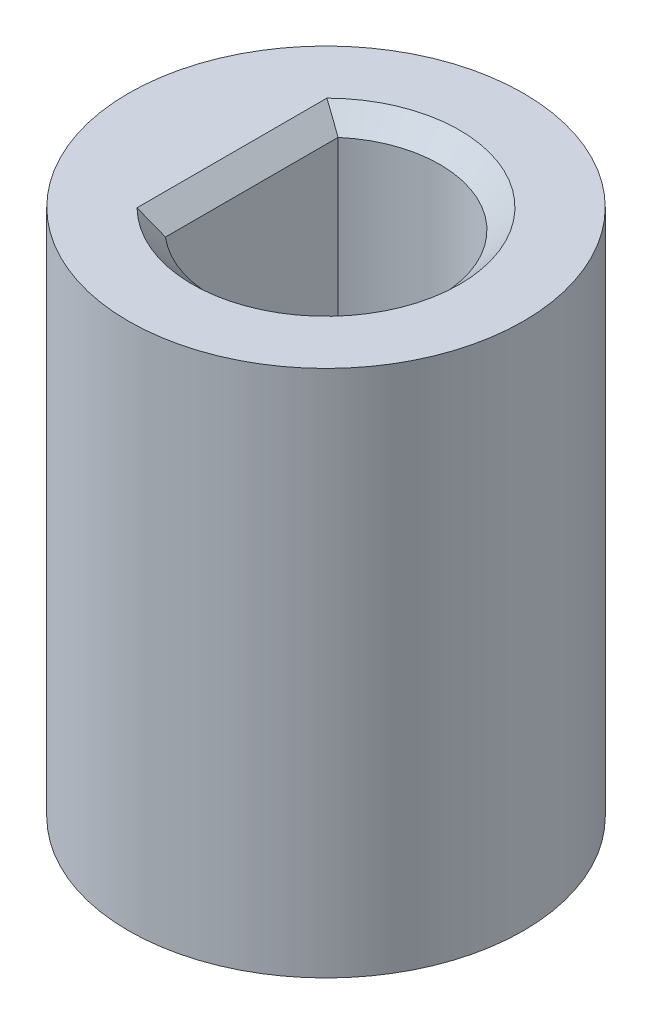
ISO-10303-21;
HEADER;
FILE_DESCRIPTION(('STEP AP214'),'2;1');
FILE_NAME('part.step','',(''),(''),'','','');
FILE_SCHEMA(('AUTOMOTIVE_DESIGN { 1 0 10303 214 1 1 1 1 }'));
ENDSEC;
DATA;
#1=APPLICATION_CONTEXT('core data for automotive mechanical design processes');
#2=APPLICATION_PROTOCOL_DEFINITION('international standard','automotive_design',2000,#1);
#3=PRODUCT_CONTEXT('',#1,'mechanical');
#4=PRODUCT('Part','Part','',(#3));
#5=PRODUCT_RELATED_PRODUCT_CATEGORY('part','',(#4));
#6=PRODUCT_DEFINITION_FORMATION('','',#4);
#7=PRODUCT_DEFINITION_CONTEXT('part definition',#1,'design');
#8=PRODUCT_DEFINITION('design','',#6,#7);
#9=PRODUCT_DEFINITION_SHAPE('','',#8);
#10=(LENGTH_UNIT() NAMED_UNIT(*) SI_UNIT(.MILLI.,.METRE.));
#11=(NAMED_UNIT(*) PLANE_ANGLE_UNIT() SI_UNIT($,.RADIAN.));
#12=(NAMED_UNIT(*) SI_UNIT($,.STERADIAN.) SOLID_ANGLE_UNIT());
#13=UNCERTAINTY_MEASURE_WITH_UNIT(LENGTH_MEASURE(1.E-05),#10,'distance_accuracy_value','');
#14=(GEOMETRIC_REPRESENTATION_CONTEXT(3) GLOBAL_UNCERTAINTY_ASSIGNED_CONTEXT((#13)) GLOBAL_UNIT_ASSIGNED_CONTEXT((#10,
#11,#12)) REPRESENTATION_CONTEXT('',''));
#15=CARTESIAN_POINT('',(0.,0.,0.));
#16=DIRECTION('',(0.,0.,1.));
#17=DIRECTION('',(1.,0.,0.));
#18=AXIS2_PLACEMENT_3D('',#15,#16,#17);
#19=CARTESIAN_POINT('',(-1.125,8.,0.));
#20=DIRECTION('',(1.,0.,0.));
#21=DIRECTION('',(0.,0.,-1.));
#22=AXIS2_PLACEMENT_3D('',#19,#20,#21);
#23=PLANE('',#22);
#24=DIRECTION('',(0.,-1.,0.));
#25=VECTOR('',#24,1.);
#26=CARTESIAN_POINT('',(-1.125,8.,-1.3076696830622));
#27=LINE('',#26,#25);
#28=CARTESIAN_POINT('',(-1.125,7.7,-1.3076696830622));
#29=VERTEX_POINT('',#28);
#30=CARTESIAN_POINT('',(-1.125,0.,-1.3076696830622));
#31=VERTEX_POINT('',#30);
#32=EDGE_CURVE('E83',#29,#31,#27,.T.);
#33=ORIENTED_EDGE('',*,*,#32,.F.);
#34=DIRECTION('',(0.,0.,1.));
#35=VECTOR('',#34,1.);
#36=CARTESIAN_POINT('',(-1.125,7.7,0.));
#37=LINE('',#36,#35);
#38=CARTESIAN_POINT('',(-1.125,7.7,1.3076696830622));
#39=VERTEX_POINT('',#38);
#40=EDGE_CURVE('E11',#29,#39,#37,.T.);
#41=ORIENTED_EDGE('',*,*,#40,.T.);
#42=DIRECTION('',(0.,-1.,0.));
#43=VECTOR('',#42,1.);
#44=CARTESIAN_POINT('',(-1.125,8.,1.3076696830622));
#45=LINE('',#44,#43);
#46=CARTESIAN_POINT('',(-1.125,0.,1.3076696830622));
#47=VERTEX_POINT('',#46);
#48=EDGE_CURVE('E91',#39,#47,#45,.T.);
#49=ORIENTED_EDGE('',*,*,#48,.T.);
#50=DIRECTION('',(0.,0.,1.));
#51=VECTOR('',#50,1.);
#52=CARTESIAN_POINT('',(-1.125,0.,0.));
#53=LINE('',#52,#51);
#54=EDGE_CURVE('E94',#31,#47,#53,.T.);
#55=ORIENTED_EDGE('',*,*,#54,.F.);
#56=EDGE_LOOP('',(#33,#41,#49,#55));
#57=FACE_BOUND('',#56,.T.);
#58=ADVANCED_FACE('F40',(#57),#23,.T.);
#59=CARTESIAN_POINT('',(0.,8.,0.));
#60=DIRECTION('',(0.,-1.,0.));
#61=DIRECTION('',(0.,0.,-1.));
#62=AXIS2_PLACEMENT_3D('',#59,#60,#61);
#63=CYLINDRICAL_SURFACE('',#62,1.725);
#64=ORIENTED_EDGE('',*,*,#48,.F.);
#65=CARTESIAN_POINT('',(0.,7.7,0.));
#66=DIRECTION('',(0.,1.,0.));
#67=DIRECTION('',(0.,0.,1.));
#68=AXIS2_PLACEMENT_3D('',#65,#66,#67);
#69=CIRCLE('',#68,1.725);
#70=EDGE_CURVE('E89',#39,#29,#69,.T.);
#71=ORIENTED_EDGE('',*,*,#70,.T.);
#72=ORIENTED_EDGE('',*,*,#32,.T.);
#73=CARTESIAN_POINT('',(0.,0.,0.));
#74=DIRECTION('',(0.,1.,0.));
#75=DIRECTION('',(0.,0.,1.));
#76=AXIS2_PLACEMENT_3D('',#73,#74,#75);
#77=CIRCLE('',#76,1.725);
#78=EDGE_CURVE('E88',#47,#31,#77,.T.);
#79=ORIENTED_EDGE('',*,*,#78,.F.);
#80=EDGE_LOOP('',(#64,#71,#72,#79));
#81=FACE_BOUND('',#80,.T.);
#82=ADVANCED_FACE('F86',(#81),#63,.F.);
#83=CARTESIAN_POINT('',(0.,8.,0.));
#84=DIRECTION('',(0.,-1.,0.));
#85=DIRECTION('',(0.,0.,-1.));
#86=AXIS2_PLACEMENT_3D('',#83,#84,#85);
#87=CYLINDRICAL_SURFACE('',#86,2.99246166358923);
#88=CARTESIAN_POINT('',(0.,8.,0.));
#89=DIRECTION('',(0.,1.,0.));
#90=DIRECTION('',(0.,0.,1.));
#91=AXIS2_PLACEMENT_3D('',#88,#89,#90);
#92=CIRCLE('',#91,2.99246166358923);
#93=CARTESIAN_POINT('',(0.,8.,2.99246166358923));
#94=VERTEX_POINT('',#93);
#95=EDGE_CURVE('E102',#94,#94,#92,.T.);
#96=ORIENTED_EDGE('',*,*,#95,.F.);
#97=EDGE_LOOP('',(#96));
#98=FACE_BOUND('',#97,.T.);
#99=CARTESIAN_POINT('',(0.,0.,0.));
#100=DIRECTION('',(0.,1.,0.));
#101=DIRECTION('',(0.,0.,1.));
#102=AXIS2_PLACEMENT_3D('',#99,#100,#101);
#103=CIRCLE('',#102,2.99246166358923);
#104=CARTESIAN_POINT('',(0.,0.,2.99246166358923));
#105=VERTEX_POINT('',#104);
#106=EDGE_CURVE('E99',#105,#105,#103,.T.);
#107=ORIENTED_EDGE('',*,*,#106,.T.);
#108=EDGE_LOOP('',(#107));
#109=FACE_BOUND('',#108,.T.);
#110=ADVANCED_FACE('F126',(#98,#109),#87,.T.);
#111=CARTESIAN_POINT('',(0.,8.,0.));
#112=DIRECTION('',(0.,1.,0.));
#113=DIRECTION('',(0.,0.,1.));
#114=AXIS2_PLACEMENT_3D('',#111,#112,#113);
#115=PLANE('',#114);
#116=DIRECTION('',(0.,0.,-1.));
#117=VECTOR('',#116,1.);
#118=CARTESIAN_POINT('',(-1.425,8.,0.));
#119=LINE('',#118,#117);
#120=CARTESIAN_POINT('',(-1.425,8.,1.43874945699382));
#121=VERTEX_POINT('',#120);
#122=CARTESIAN_POINT('',(-1.425,8.,-1.43874945699382));
#123=VERTEX_POINT('',#122);
#124=EDGE_CURVE('E62',#121,#123,#119,.T.);
#125=ORIENTED_EDGE('',*,*,#124,.T.);
#126=CARTESIAN_POINT('',(0.,8.,0.));
#127=DIRECTION('',(0.,1.,0.));
#128=DIRECTION('',(0.,0.,1.));
#129=AXIS2_PLACEMENT_3D('',#126,#127,#128);
#130=CIRCLE('',#129,2.025);
#131=EDGE_CURVE('E55',#123,#121,#130,.F.);
#132=ORIENTED_EDGE('',*,*,#131,.T.);
#133=EDGE_LOOP('',(#125,#132));
#134=FACE_BOUND('',#133,.T.);
#135=ORIENTED_EDGE('',*,*,#95,.T.);
#136=EDGE_LOOP('',(#135));
#137=FACE_BOUND('',#136,.T.);
#138=ADVANCED_FACE('F129',(#134,#137),#115,.T.);
#139=CARTESIAN_POINT('',(0.,0.,0.));
#140=DIRECTION('',(0.,1.,0.));
#141=DIRECTION('',(0.,0.,1.));
#142=AXIS2_PLACEMENT_3D('',#139,#140,#141);
#143=PLANE('',#142);
#144=ORIENTED_EDGE('',*,*,#54,.T.);
#145=ORIENTED_EDGE('',*,*,#78,.T.);
#146=EDGE_LOOP('',(#144,#145));
#147=FACE_BOUND('',#146,.T.);
#148=ORIENTED_EDGE('',*,*,#106,.F.);
#149=EDGE_LOOP('',(#148));
#150=FACE_BOUND('',#149,.T.);
#151=ADVANCED_FACE('F97',(#147,#150),#143,.F.);
#152=CARTESIAN_POINT('',(-1.125,7.7,0.));
#153=DIRECTION('',(-0.707106781186545,-0.70710678118655,0.));
#154=DIRECTION('',(0.,0.,1.));
#155=AXIS2_PLACEMENT_3D('',#152,#153,#154);
#156=PLANE('',#155);
#157=CARTESIAN_POINT('',(-1.125,7.7,-1.3076696830622));
#158=CARTESIAN_POINT('',(-1.17479233663844,7.74979233663845,-1.33046777184846));
#159=CARTESIAN_POINT('',(-1.22468859594161,7.79968859594161,-1.35279016860113));
#160=CARTESIAN_POINT('',(-1.32468859744819,7.89968859744818,-1.39648341968219));
#161=CARTESIAN_POINT('',(-1.37479233814502,7.94979233814502,-1.41785428090673));
#162=CARTESIAN_POINT('',(-1.425,8.,-1.43874945699382));
#163=B_SPLINE_CURVE_WITH_KNOTS('',3,(#157,#158,#159,#160,#161,#162),.UNSPECIFIED.,.F.,.F.,(4,2,
4),(0.,0.222031675747249,0.444061742085084),.UNSPECIFIED.);
#164=EDGE_CURVE('E109',#123,#29,#163,.F.);
#165=ORIENTED_EDGE('',*,*,#164,.F.);
#166=ORIENTED_EDGE('',*,*,#124,.F.);
#167=CARTESIAN_POINT('',(-1.425,8.,1.43874945699382));
#168=CARTESIAN_POINT('',(-1.37479233814502,7.94979233814502,1.41785428090673));
#169=CARTESIAN_POINT('',(-1.32468859744819,7.89968859744818,1.39648341968219));
#170=CARTESIAN_POINT('',(-1.22468859594161,7.79968859594161,1.35279016860113));
#171=CARTESIAN_POINT('',(-1.17479233663845,7.74979233663845,1.33046777184846));
#172=CARTESIAN_POINT('',(-1.125,7.7,1.3076696830622));
#173=B_SPLINE_CURVE_WITH_KNOTS('',3,(#167,#168,#169,#170,#171,#172),.UNSPECIFIED.,.F.,.F.,(4,2,
4),(0.,0.222030066337836,0.444061742085084),.UNSPECIFIED.);
#174=EDGE_CURVE('E46',#39,#121,#173,.F.);
#175=ORIENTED_EDGE('',*,*,#174,.F.);
#176=ORIENTED_EDGE('',*,*,#40,.F.);
#177=EDGE_LOOP('',(#165,#166,#175,#176));
#178=FACE_BOUND('',#177,.T.);
#179=ADVANCED_FACE('F43',(#178),#156,.F.);
#180=CARTESIAN_POINT('',(0.,7.7,0.));
#181=DIRECTION('',(0.,1.,0.));
#182=DIRECTION('',(0.,0.,1.));
#183=AXIS2_PLACEMENT_3D('',#180,#181,#182);
#184=CONICAL_SURFACE('',#183,1.725,0.785398163397451);
#185=ORIENTED_EDGE('',*,*,#174,.T.);
#186=ORIENTED_EDGE('',*,*,#131,.F.);
#187=ORIENTED_EDGE('',*,*,#164,.T.);
#188=ORIENTED_EDGE('',*,*,#70,.F.);
#189=EDGE_LOOP('',(#185,#186,#187,#188));
#190=FACE_BOUND('',#189,.T.);
#191=ADVANCED_FACE('F115',(#190),#184,.F.);
#192=CLOSED_SHELL('',(#58,#82,#110,#138,#151,#179,#191));
#193=MANIFOLD_SOLID_BREP('B2',#192);
#194=ADVANCED_BREP_SHAPE_REPRESENTATION('',(#18,#193),#14);
#195=SHAPE_DEFINITION_REPRESENTATION(#9,#194);
ENDSEC;
END-ISO-10303-21;
